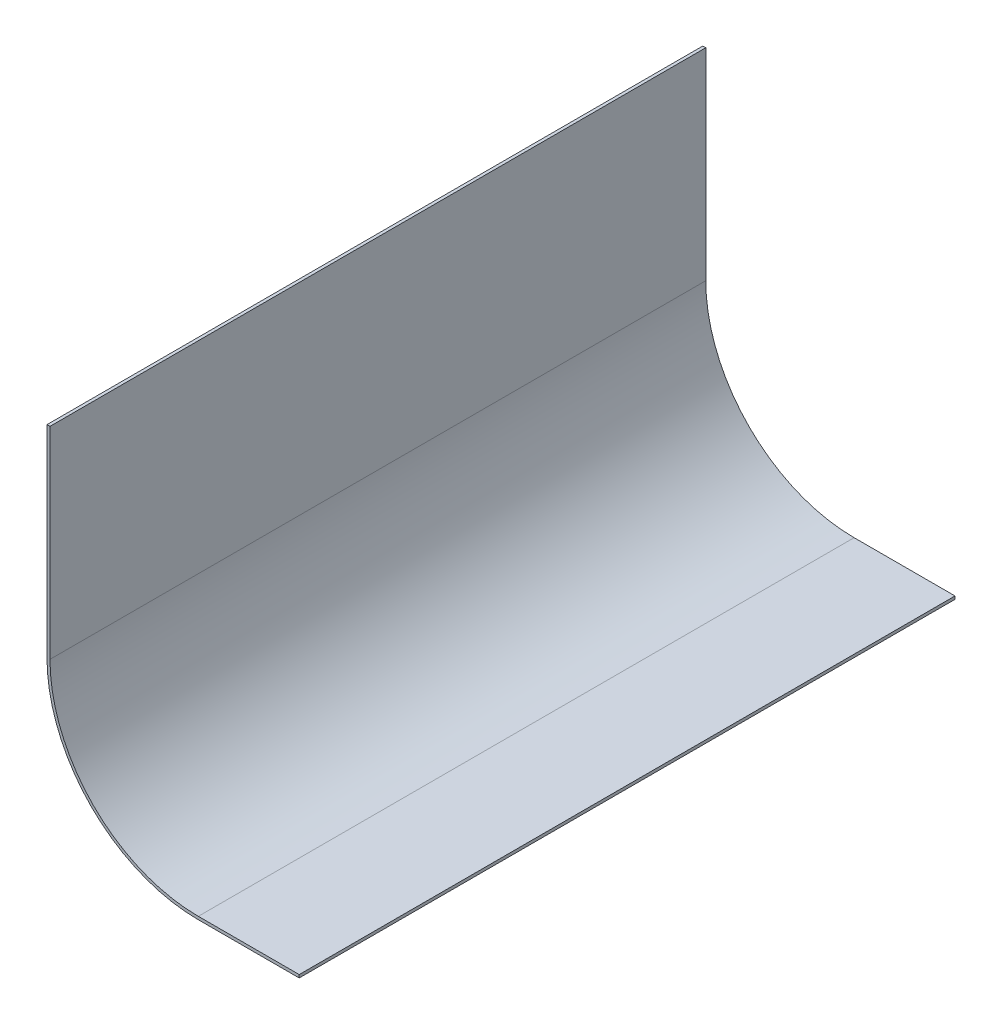
ISO-10303-21;
HEADER;
FILE_DESCRIPTION(('STEP AP214'),'2;1');
FILE_NAME('part.step','',(''),(''),'','','');
FILE_SCHEMA(('AUTOMOTIVE_DESIGN { 1 0 10303 214 1 1 1 1 }'));
ENDSEC;
DATA;
#1=APPLICATION_CONTEXT('core data for automotive mechanical design processes');
#2=APPLICATION_PROTOCOL_DEFINITION('international standard','automotive_design',2000,#1);
#3=PRODUCT_CONTEXT('',#1,'mechanical');
#4=PRODUCT('Part','Part','',(#3));
#5=PRODUCT_RELATED_PRODUCT_CATEGORY('part','',(#4));
#6=PRODUCT_DEFINITION_FORMATION('','',#4);
#7=PRODUCT_DEFINITION_CONTEXT('part definition',#1,'design');
#8=PRODUCT_DEFINITION('design','',#6,#7);
#9=PRODUCT_DEFINITION_SHAPE('','',#8);
#10=(LENGTH_UNIT() NAMED_UNIT(*) SI_UNIT(.MILLI.,.METRE.));
#11=(NAMED_UNIT(*) PLANE_ANGLE_UNIT() SI_UNIT($,.RADIAN.));
#12=(NAMED_UNIT(*) SI_UNIT($,.STERADIAN.) SOLID_ANGLE_UNIT());
#13=UNCERTAINTY_MEASURE_WITH_UNIT(LENGTH_MEASURE(1.E-05),#10,'distance_accuracy_value','');
#14=(GEOMETRIC_REPRESENTATION_CONTEXT(3) GLOBAL_UNCERTAINTY_ASSIGNED_CONTEXT((#13)) GLOBAL_UNIT_ASSIGNED_CONTEXT((#10,
#11,#12)) REPRESENTATION_CONTEXT('',''));
#15=CARTESIAN_POINT('',(0.,0.,0.));
#16=DIRECTION('',(0.,0.,1.));
#17=DIRECTION('',(1.,0.,0.));
#18=AXIS2_PLACEMENT_3D('',#15,#16,#17);
#19=CARTESIAN_POINT('',(-543.675,1066.8,165.1));
#20=DIRECTION('',(-1.,0.,0.));
#21=DIRECTION('',(0.,0.,1.));
#22=AXIS2_PLACEMENT_3D('',#19,#20,#21);
#23=PLANE('',#22);
#24=DIRECTION('',(0.,1.,0.));
#25=VECTOR('',#24,1.);
#26=CARTESIAN_POINT('',(-543.675,1066.8,-165.1));
#27=LINE('',#26,#25);
#28=CARTESIAN_POINT('',(-543.675,1066.8,-165.1));
#29=VERTEX_POINT('',#28);
#30=CARTESIAN_POINT('',(-543.675,1168.4,-165.1));
#31=VERTEX_POINT('',#30);
#32=EDGE_CURVE('E143',#29,#31,#27,.T.);
#33=ORIENTED_EDGE('',*,*,#32,.T.);
#34=DIRECTION('',(0.,0.,-1.));
#35=VECTOR('',#34,1.);
#36=CARTESIAN_POINT('',(-543.675,1168.4,165.1));
#37=LINE('',#36,#35);
#38=CARTESIAN_POINT('',(-543.675,1168.4,165.1));
#39=VERTEX_POINT('',#38);
#40=EDGE_CURVE('E11',#39,#31,#37,.T.);
#41=ORIENTED_EDGE('',*,*,#40,.F.);
#42=DIRECTION('',(0.,1.,0.));
#43=VECTOR('',#42,1.);
#44=CARTESIAN_POINT('',(-543.675,1066.8,165.1));
#45=LINE('',#44,#43);
#46=CARTESIAN_POINT('',(-543.675,1066.8,165.1));
#47=VERTEX_POINT('',#46);
#48=EDGE_CURVE('E100',#47,#39,#45,.T.);
#49=ORIENTED_EDGE('',*,*,#48,.F.);
#50=DIRECTION('',(0.,0.,-1.));
#51=VECTOR('',#50,1.);
#52=CARTESIAN_POINT('',(-543.675,1066.8,165.1));
#53=LINE('',#52,#51);
#54=EDGE_CURVE('E142',#47,#29,#53,.T.);
#55=ORIENTED_EDGE('',*,*,#54,.T.);
#56=EDGE_LOOP('',(#33,#41,#49,#55));
#57=FACE_BOUND('',#56,.T.);
#58=ADVANCED_FACE('F41',(#57),#23,.F.);
#59=CARTESIAN_POINT('',(-545.175,1168.4,165.1));
#60=DIRECTION('',(0.,1.,0.));
#61=DIRECTION('',(0.,0.,1.));
#62=AXIS2_PLACEMENT_3D('',#59,#60,#61);
#63=PLANE('',#62);
#64=DIRECTION('',(1.,0.,0.));
#65=VECTOR('',#64,1.);
#66=CARTESIAN_POINT('',(-545.175,1168.4,-165.1));
#67=LINE('',#66,#65);
#68=CARTESIAN_POINT('',(-545.175,1168.4,-165.1));
#69=VERTEX_POINT('',#68);
#70=EDGE_CURVE('E146',#69,#31,#67,.T.);
#71=ORIENTED_EDGE('',*,*,#70,.F.);
#72=DIRECTION('',(0.,0.,-1.));
#73=VECTOR('',#72,1.);
#74=CARTESIAN_POINT('',(-545.175,1168.4,165.1));
#75=LINE('',#74,#73);
#76=CARTESIAN_POINT('',(-545.175,1168.4,165.1));
#77=VERTEX_POINT('',#76);
#78=EDGE_CURVE('E49',#77,#69,#75,.T.);
#79=ORIENTED_EDGE('',*,*,#78,.F.);
#80=DIRECTION('',(1.,0.,0.));
#81=VECTOR('',#80,1.);
#82=CARTESIAN_POINT('',(-545.175,1168.4,165.1));
#83=LINE('',#82,#81);
#84=EDGE_CURVE('E193',#77,#39,#83,.T.);
#85=ORIENTED_EDGE('',*,*,#84,.T.);
#86=ORIENTED_EDGE('',*,*,#40,.T.);
#87=EDGE_LOOP('',(#71,#79,#85,#86));
#88=FACE_BOUND('',#87,.T.);
#89=ADVANCED_FACE('F184',(#88),#63,.T.);
#90=CARTESIAN_POINT('',(-545.175,1066.8,165.1));
#91=DIRECTION('',(-1.,0.,0.));
#92=DIRECTION('',(0.,0.,1.));
#93=AXIS2_PLACEMENT_3D('',#90,#91,#92);
#94=PLANE('',#93);
#95=DIRECTION('',(0.,1.,0.));
#96=VECTOR('',#95,1.);
#97=CARTESIAN_POINT('',(-545.175,1066.8,-165.1));
#98=LINE('',#97,#96);
#99=CARTESIAN_POINT('',(-545.175,1066.8,-165.1));
#100=VERTEX_POINT('',#99);
#101=EDGE_CURVE('E149',#100,#69,#98,.T.);
#102=ORIENTED_EDGE('',*,*,#101,.F.);
#103=DIRECTION('',(0.,0.,-1.));
#104=VECTOR('',#103,1.);
#105=CARTESIAN_POINT('',(-545.175,1066.8,165.1));
#106=LINE('',#105,#104);
#107=CARTESIAN_POINT('',(-545.175,1066.8,165.1));
#108=VERTEX_POINT('',#107);
#109=EDGE_CURVE('E174',#108,#100,#106,.T.);
#110=ORIENTED_EDGE('',*,*,#109,.F.);
#111=DIRECTION('',(0.,1.,0.));
#112=VECTOR('',#111,1.);
#113=CARTESIAN_POINT('',(-545.175,1066.8,165.1));
#114=LINE('',#113,#112);
#115=EDGE_CURVE('E181',#108,#77,#114,.T.);
#116=ORIENTED_EDGE('',*,*,#115,.T.);
#117=ORIENTED_EDGE('',*,*,#78,.T.);
#118=EDGE_LOOP('',(#102,#110,#116,#117));
#119=FACE_BOUND('',#118,.T.);
#120=ADVANCED_FACE('F179',(#119),#94,.T.);
#121=CARTESIAN_POINT('',(-468.975,1066.8,165.1));
#122=DIRECTION('',(0.,0.,-1.));
#123=DIRECTION('',(-1.,0.,0.));
#124=AXIS2_PLACEMENT_3D('',#121,#122,#123);
#125=CYLINDRICAL_SURFACE('',#124,76.2);
#126=CARTESIAN_POINT('',(-468.975,1066.8,-165.1));
#127=DIRECTION('',(0.,0.,-1.));
#128=DIRECTION('',(-1.,0.,0.));
#129=AXIS2_PLACEMENT_3D('',#126,#127,#128);
#130=CIRCLE('',#129,76.2);
#131=CARTESIAN_POINT('',(-468.975,990.6,-165.1));
#132=VERTEX_POINT('',#131);
#133=EDGE_CURVE('E152',#132,#100,#130,.T.);
#134=ORIENTED_EDGE('',*,*,#133,.F.);
#135=DIRECTION('',(0.,0.,-1.));
#136=VECTOR('',#135,1.);
#137=CARTESIAN_POINT('',(-468.975,990.6,165.1));
#138=LINE('',#137,#136);
#139=CARTESIAN_POINT('',(-468.975,990.6,165.1));
#140=VERTEX_POINT('',#139);
#141=EDGE_CURVE('E171',#140,#132,#138,.T.);
#142=ORIENTED_EDGE('',*,*,#141,.F.);
#143=CARTESIAN_POINT('',(-468.975,1066.8,165.1));
#144=DIRECTION('',(0.,0.,-1.));
#145=DIRECTION('',(-1.,0.,0.));
#146=AXIS2_PLACEMENT_3D('',#143,#144,#145);
#147=CIRCLE('',#146,76.2);
#148=EDGE_CURVE('E137',#140,#108,#147,.T.);
#149=ORIENTED_EDGE('',*,*,#148,.T.);
#150=ORIENTED_EDGE('',*,*,#109,.T.);
#151=EDGE_LOOP('',(#134,#142,#149,#150));
#152=FACE_BOUND('',#151,.T.);
#153=ADVANCED_FACE('F191',(#152),#125,.T.);
#154=CARTESIAN_POINT('',(-418.175,990.6,165.1));
#155=DIRECTION('',(0.,-1.,0.));
#156=DIRECTION('',(1.,0.,0.));
#157=AXIS2_PLACEMENT_3D('',#154,#155,#156);
#158=PLANE('',#157);
#159=DIRECTION('',(-1.,0.,0.));
#160=VECTOR('',#159,1.);
#161=CARTESIAN_POINT('',(-418.175,990.6,-165.1));
#162=LINE('',#161,#160);
#163=CARTESIAN_POINT('',(-418.175,990.6,-165.1));
#164=VERTEX_POINT('',#163);
#165=EDGE_CURVE('E156',#164,#132,#162,.T.);
#166=ORIENTED_EDGE('',*,*,#165,.F.);
#167=DIRECTION('',(0.,0.,-1.));
#168=VECTOR('',#167,1.);
#169=CARTESIAN_POINT('',(-418.175,990.6,165.1));
#170=LINE('',#169,#168);
#171=CARTESIAN_POINT('',(-418.175,990.6,165.1));
#172=VERTEX_POINT('',#171);
#173=EDGE_CURVE('E125',#172,#164,#170,.T.);
#174=ORIENTED_EDGE('',*,*,#173,.F.);
#175=DIRECTION('',(-1.,0.,0.));
#176=VECTOR('',#175,1.);
#177=CARTESIAN_POINT('',(-418.175,990.6,165.1));
#178=LINE('',#177,#176);
#179=EDGE_CURVE('E135',#172,#140,#178,.T.);
#180=ORIENTED_EDGE('',*,*,#179,.T.);
#181=ORIENTED_EDGE('',*,*,#141,.T.);
#182=EDGE_LOOP('',(#166,#174,#180,#181));
#183=FACE_BOUND('',#182,.T.);
#184=ADVANCED_FACE('F198',(#183),#158,.T.);
#185=CARTESIAN_POINT('',(-418.175,992.1,165.1));
#186=DIRECTION('',(1.,0.,0.));
#187=DIRECTION('',(0.,0.,-1.));
#188=AXIS2_PLACEMENT_3D('',#185,#186,#187);
#189=PLANE('',#188);
#190=DIRECTION('',(0.,-1.,0.));
#191=VECTOR('',#190,1.);
#192=CARTESIAN_POINT('',(-418.175,992.1,-165.1));
#193=LINE('',#192,#191);
#194=CARTESIAN_POINT('',(-418.175,992.1,-165.1));
#195=VERTEX_POINT('',#194);
#196=EDGE_CURVE('E123',#195,#164,#193,.T.);
#197=ORIENTED_EDGE('',*,*,#196,.F.);
#198=DIRECTION('',(0.,0.,-1.));
#199=VECTOR('',#198,1.);
#200=CARTESIAN_POINT('',(-418.175,992.1,165.1));
#201=LINE('',#200,#199);
#202=CARTESIAN_POINT('',(-418.175,992.1,165.1));
#203=VERTEX_POINT('',#202);
#204=EDGE_CURVE('E117',#203,#195,#201,.T.);
#205=ORIENTED_EDGE('',*,*,#204,.F.);
#206=DIRECTION('',(0.,-1.,0.));
#207=VECTOR('',#206,1.);
#208=CARTESIAN_POINT('',(-418.175,992.1,165.1));
#209=LINE('',#208,#207);
#210=EDGE_CURVE('E121',#203,#172,#209,.T.);
#211=ORIENTED_EDGE('',*,*,#210,.T.);
#212=ORIENTED_EDGE('',*,*,#173,.T.);
#213=EDGE_LOOP('',(#197,#205,#211,#212));
#214=FACE_BOUND('',#213,.T.);
#215=ADVANCED_FACE('F119',(#214),#189,.T.);
#216=CARTESIAN_POINT('',(-418.175,992.1,165.1));
#217=DIRECTION('',(0.,-1.,0.));
#218=DIRECTION('',(1.,0.,0.));
#219=AXIS2_PLACEMENT_3D('',#216,#217,#218);
#220=PLANE('',#219);
#221=DIRECTION('',(-1.,0.,0.));
#222=VECTOR('',#221,1.);
#223=CARTESIAN_POINT('',(-418.175,992.1,-165.1));
#224=LINE('',#223,#222);
#225=CARTESIAN_POINT('',(-468.975,992.1,-165.1));
#226=VERTEX_POINT('',#225);
#227=EDGE_CURVE('E88',#195,#226,#224,.T.);
#228=ORIENTED_EDGE('',*,*,#227,.T.);
#229=DIRECTION('',(0.,0.,-1.));
#230=VECTOR('',#229,1.);
#231=CARTESIAN_POINT('',(-468.975,992.1,165.1));
#232=LINE('',#231,#230);
#233=CARTESIAN_POINT('',(-468.975,992.1,165.1));
#234=VERTEX_POINT('',#233);
#235=EDGE_CURVE('E126',#234,#226,#232,.T.);
#236=ORIENTED_EDGE('',*,*,#235,.F.);
#237=DIRECTION('',(-1.,0.,0.));
#238=VECTOR('',#237,1.);
#239=CARTESIAN_POINT('',(-418.175,992.1,165.1));
#240=LINE('',#239,#238);
#241=EDGE_CURVE('E128',#203,#234,#240,.T.);
#242=ORIENTED_EDGE('',*,*,#241,.F.);
#243=ORIENTED_EDGE('',*,*,#204,.T.);
#244=EDGE_LOOP('',(#228,#236,#242,#243));
#245=FACE_BOUND('',#244,.T.);
#246=ADVANCED_FACE('F129',(#245),#220,.F.);
#247=CARTESIAN_POINT('',(-468.975,1066.8,165.1));
#248=DIRECTION('',(0.,0.,-1.));
#249=DIRECTION('',(-1.,0.,0.));
#250=AXIS2_PLACEMENT_3D('',#247,#248,#249);
#251=CYLINDRICAL_SURFACE('',#250,74.7);
#252=CARTESIAN_POINT('',(-468.975,1066.8,-165.1));
#253=DIRECTION('',(0.,0.,1.));
#254=DIRECTION('',(1.,0.,0.));
#255=AXIS2_PLACEMENT_3D('',#252,#253,#254);
#256=CIRCLE('',#255,74.7);
#257=EDGE_CURVE('E94',#226,#29,#256,.F.);
#258=ORIENTED_EDGE('',*,*,#257,.T.);
#259=ORIENTED_EDGE('',*,*,#54,.F.);
#260=CARTESIAN_POINT('',(-468.975,1066.8,165.1));
#261=DIRECTION('',(0.,0.,1.));
#262=DIRECTION('',(1.,0.,0.));
#263=AXIS2_PLACEMENT_3D('',#260,#261,#262);
#264=CIRCLE('',#263,74.7);
#265=EDGE_CURVE('E57',#234,#47,#264,.F.);
#266=ORIENTED_EDGE('',*,*,#265,.F.);
#267=ORIENTED_EDGE('',*,*,#235,.T.);
#268=EDGE_LOOP('',(#258,#259,#266,#267));
#269=FACE_BOUND('',#268,.T.);
#270=ADVANCED_FACE('F200',(#269),#251,.F.);
#271=CARTESIAN_POINT('',(-468.975,1066.8,165.1));
#272=DIRECTION('',(0.,0.,-1.));
#273=DIRECTION('',(-1.,0.,0.));
#274=AXIS2_PLACEMENT_3D('',#271,#272,#273);
#275=PLANE('',#274);
#276=ORIENTED_EDGE('',*,*,#48,.T.);
#277=ORIENTED_EDGE('',*,*,#84,.F.);
#278=ORIENTED_EDGE('',*,*,#115,.F.);
#279=ORIENTED_EDGE('',*,*,#148,.F.);
#280=ORIENTED_EDGE('',*,*,#179,.F.);
#281=ORIENTED_EDGE('',*,*,#210,.F.);
#282=ORIENTED_EDGE('',*,*,#241,.T.);
#283=ORIENTED_EDGE('',*,*,#265,.T.);
#284=EDGE_LOOP('',(#276,#277,#278,#279,#280,#281,#282,#283));
#285=FACE_BOUND('',#284,.T.);
#286=ADVANCED_FACE('F132',(#285),#275,.F.);
#287=CARTESIAN_POINT('',(-468.975,1066.8,-165.1));
#288=DIRECTION('',(0.,0.,-1.));
#289=DIRECTION('',(-1.,0.,0.));
#290=AXIS2_PLACEMENT_3D('',#287,#288,#289);
#291=PLANE('',#290);
#292=ORIENTED_EDGE('',*,*,#32,.F.);
#293=ORIENTED_EDGE('',*,*,#257,.F.);
#294=ORIENTED_EDGE('',*,*,#227,.F.);
#295=ORIENTED_EDGE('',*,*,#196,.T.);
#296=ORIENTED_EDGE('',*,*,#165,.T.);
#297=ORIENTED_EDGE('',*,*,#133,.T.);
#298=ORIENTED_EDGE('',*,*,#101,.T.);
#299=ORIENTED_EDGE('',*,*,#70,.T.);
#300=EDGE_LOOP('',(#292,#293,#294,#295,#296,#297,#298,#299));
#301=FACE_BOUND('',#300,.T.);
#302=ADVANCED_FACE('F187',(#301),#291,.T.);
#303=CLOSED_SHELL('',(#58,#89,#120,#153,#184,#215,#246,#270,#286,#302));
#304=MANIFOLD_SOLID_BREP('B2',#303);
#305=ADVANCED_BREP_SHAPE_REPRESENTATION('',(#18,#304),#14);
#306=SHAPE_DEFINITION_REPRESENTATION(#9,#305);
ENDSEC;
END-ISO-10303-21;
